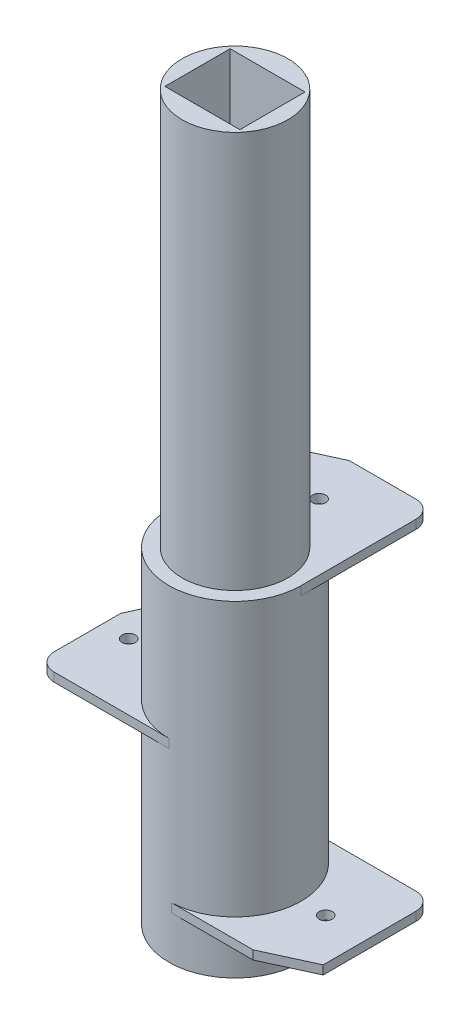
ISO-10303-21;
HEADER;
FILE_DESCRIPTION(('STEP AP214'),'2;1');
FILE_NAME('part.step','',(''),(''),'','','');
FILE_SCHEMA(('AUTOMOTIVE_DESIGN { 1 0 10303 214 1 1 1 1 }'));
ENDSEC;
DATA;
#1=APPLICATION_CONTEXT('core data for automotive mechanical design processes');
#2=APPLICATION_PROTOCOL_DEFINITION('international standard','automotive_design',2000,#1);
#3=PRODUCT_CONTEXT('',#1,'mechanical');
#4=PRODUCT('Part','Part','',(#3));
#5=PRODUCT_RELATED_PRODUCT_CATEGORY('part','',(#4));
#6=PRODUCT_DEFINITION_FORMATION('','',#4);
#7=PRODUCT_DEFINITION_CONTEXT('part definition',#1,'design');
#8=PRODUCT_DEFINITION('design','',#6,#7);
#9=PRODUCT_DEFINITION_SHAPE('','',#8);
#10=(LENGTH_UNIT() NAMED_UNIT(*) SI_UNIT(.MILLI.,.METRE.));
#11=(NAMED_UNIT(*) PLANE_ANGLE_UNIT() SI_UNIT($,.RADIAN.));
#12=(NAMED_UNIT(*) SI_UNIT($,.STERADIAN.) SOLID_ANGLE_UNIT());
#13=UNCERTAINTY_MEASURE_WITH_UNIT(LENGTH_MEASURE(1.E-05),#10,'distance_accuracy_value','');
#14=(GEOMETRIC_REPRESENTATION_CONTEXT(3) GLOBAL_UNCERTAINTY_ASSIGNED_CONTEXT((#13)) GLOBAL_UNIT_ASSIGNED_CONTEXT((#10,
#11,#12)) REPRESENTATION_CONTEXT('',''));
#15=CARTESIAN_POINT('',(0.,0.,0.));
#16=DIRECTION('',(0.,0.,1.));
#17=DIRECTION('',(1.,0.,0.));
#18=AXIS2_PLACEMENT_3D('',#15,#16,#17);
#19=CARTESIAN_POINT('',(0.,6.,-7.5));
#20=DIRECTION('',(0.,0.,-1.));
#21=DIRECTION('',(-1.,0.,0.));
#22=AXIS2_PLACEMENT_3D('',#19,#20,#21);
#23=PLANE('',#22);
#24=DIRECTION('',(1.,0.,0.));
#25=VECTOR('',#24,1.);
#26=CARTESIAN_POINT('',(0.,6.,-7.5));
#27=LINE('',#26,#25);
#28=CARTESIAN_POINT('',(0.,6.,-7.5));
#29=VERTEX_POINT('',#28);
#30=CARTESIAN_POINT('',(13.,6.,-7.5));
#31=VERTEX_POINT('',#30);
#32=EDGE_CURVE('E108',#29,#31,#27,.T.);
#33=ORIENTED_EDGE('',*,*,#32,.T.);
#34=DIRECTION('',(0.,-1.,0.));
#35=VECTOR('',#34,1.);
#36=CARTESIAN_POINT('',(13.,6.,-7.5));
#37=LINE('',#36,#35);
#38=CARTESIAN_POINT('',(13.,5.,-7.5));
#39=VERTEX_POINT('',#38);
#40=EDGE_CURVE('E144',#31,#39,#37,.T.);
#41=ORIENTED_EDGE('',*,*,#40,.T.);
#42=DIRECTION('',(1.,0.,0.));
#43=VECTOR('',#42,1.);
#44=CARTESIAN_POINT('',(0.,5.,-7.5));
#45=LINE('',#44,#43);
#46=CARTESIAN_POINT('',(0.,5.,-7.5));
#47=VERTEX_POINT('',#46);
#48=EDGE_CURVE('E123',#47,#39,#45,.T.);
#49=ORIENTED_EDGE('',*,*,#48,.F.);
#50=DIRECTION('',(0.,-1.,0.));
#51=VECTOR('',#50,1.);
#52=CARTESIAN_POINT('',(0.,6.,-7.5));
#53=LINE('',#52,#51);
#54=EDGE_CURVE('E142',#29,#47,#53,.T.);
#55=ORIENTED_EDGE('',*,*,#54,.F.);
#56=EDGE_LOOP('',(#33,#41,#49,#55));
#57=FACE_BOUND('',#56,.T.);
#58=ADVANCED_FACE('F50',(#57),#23,.T.);
#59=CARTESIAN_POINT('',(0.,6.,0.00250088414878794));
#60=DIRECTION('',(0.,-1.,0.));
#61=DIRECTION('',(0.,0.,-1.));
#62=AXIS2_PLACEMENT_3D('',#59,#60,#61);
#63=CYLINDRICAL_SURFACE('',#62,7.50250088414879);
#64=CARTESIAN_POINT('',(0.,5.,0.00250088414878794));
#65=DIRECTION('',(0.,1.,0.));
#66=DIRECTION('',(0.,0.,1.));
#67=AXIS2_PLACEMENT_3D('',#64,#65,#66);
#68=CIRCLE('',#67,7.50250088414879);
#69=CARTESIAN_POINT('',(0.273045899963733,5.,7.50003150783859));
#70=VERTEX_POINT('',#69);
#71=EDGE_CURVE('E137',#47,#70,#68,.F.);
#72=ORIENTED_EDGE('',*,*,#71,.T.);
#73=DIRECTION('',(0.,-1.,0.));
#74=VECTOR('',#73,1.);
#75=CARTESIAN_POINT('',(0.273045899963733,6.,7.50003150783859));
#76=LINE('',#75,#74);
#77=CARTESIAN_POINT('',(0.273045899963733,6.,7.50003150783859));
#78=VERTEX_POINT('',#77);
#79=EDGE_CURVE('E135',#78,#70,#76,.T.);
#80=ORIENTED_EDGE('',*,*,#79,.F.);
#81=CARTESIAN_POINT('',(0.,6.,0.00250088414878794));
#82=DIRECTION('',(0.,1.,0.));
#83=DIRECTION('',(0.,0.,1.));
#84=AXIS2_PLACEMENT_3D('',#81,#82,#83);
#85=CIRCLE('',#84,7.50250088414879);
#86=EDGE_CURVE('E129',#29,#78,#85,.F.);
#87=ORIENTED_EDGE('',*,*,#86,.F.);
#88=ORIENTED_EDGE('',*,*,#54,.T.);
#89=EDGE_LOOP('',(#72,#80,#87,#88));
#90=FACE_BOUND('',#89,.T.);
#91=ADVANCED_FACE('F168',(#90),#63,.F.);
#92=CARTESIAN_POINT('',(0.,6.,7.50003150783859));
#93=DIRECTION('',(0.,0.,-1.));
#94=DIRECTION('',(-1.,0.,0.));
#95=AXIS2_PLACEMENT_3D('',#92,#93,#94);
#96=PLANE('',#95);
#97=DIRECTION('',(1.,0.,0.));
#98=VECTOR('',#97,1.);
#99=CARTESIAN_POINT('',(0.,5.,7.50003150783859));
#100=LINE('',#99,#98);
#101=CARTESIAN_POINT('',(9.54564394268214,5.,7.50003150783859));
#102=VERTEX_POINT('',#101);
#103=EDGE_CURVE('E109',#70,#102,#100,.T.);
#104=ORIENTED_EDGE('',*,*,#103,.T.);
#105=DIRECTION('',(0.,1.,0.));
#106=VECTOR('',#105,1.);
#107=CARTESIAN_POINT('',(9.54564394268214,5.,7.50003150783859));
#108=LINE('',#107,#106);
#109=CARTESIAN_POINT('',(9.54564394268214,6.,7.50003150783859));
#110=VERTEX_POINT('',#109);
#111=EDGE_CURVE('E117',#102,#110,#108,.T.);
#112=ORIENTED_EDGE('',*,*,#111,.T.);
#113=DIRECTION('',(1.,0.,0.));
#114=VECTOR('',#113,1.);
#115=CARTESIAN_POINT('',(0.,6.,7.50003150783859));
#116=LINE('',#115,#114);
#117=EDGE_CURVE('E131',#78,#110,#116,.T.);
#118=ORIENTED_EDGE('',*,*,#117,.F.);
#119=ORIENTED_EDGE('',*,*,#79,.T.);
#120=EDGE_LOOP('',(#104,#112,#118,#119));
#121=FACE_BOUND('',#120,.T.);
#122=ADVANCED_FACE('F172',(#121),#96,.F.);
#123=CARTESIAN_POINT('',(15.,6.,0.));
#124=DIRECTION('',(1.,0.,0.));
#125=DIRECTION('',(0.,0.,-1.));
#126=AXIS2_PLACEMENT_3D('',#123,#124,#125);
#127=PLANE('',#126);
#128=DIRECTION('',(0.,0.,1.));
#129=VECTOR('',#128,1.);
#130=CARTESIAN_POINT('',(15.,5.,0.));
#131=LINE('',#130,#129);
#132=CARTESIAN_POINT('',(15.,5.,-5.5));
#133=VERTEX_POINT('',#132);
#134=CARTESIAN_POINT('',(15.,5.,5.00003150783859));
#135=VERTEX_POINT('',#134);
#136=EDGE_CURVE('E101',#133,#135,#131,.T.);
#137=ORIENTED_EDGE('',*,*,#136,.F.);
#138=DIRECTION('',(0.,-1.,0.));
#139=VECTOR('',#138,1.);
#140=CARTESIAN_POINT('',(15.,6.,-5.5));
#141=LINE('',#140,#139);
#142=CARTESIAN_POINT('',(15.,6.,-5.5));
#143=VERTEX_POINT('',#142);
#144=EDGE_CURVE('E65',#133,#143,#141,.F.);
#145=ORIENTED_EDGE('',*,*,#144,.T.);
#146=DIRECTION('',(0.,0.,1.));
#147=VECTOR('',#146,1.);
#148=CARTESIAN_POINT('',(15.,6.,0.));
#149=LINE('',#148,#147);
#150=CARTESIAN_POINT('',(15.,6.,5.00003150783859));
#151=VERTEX_POINT('',#150);
#152=EDGE_CURVE('E121',#143,#151,#149,.T.);
#153=ORIENTED_EDGE('',*,*,#152,.T.);
#154=DIRECTION('',(0.,1.,0.));
#155=VECTOR('',#154,1.);
#156=CARTESIAN_POINT('',(15.,5.,5.00003150783859));
#157=LINE('',#156,#155);
#158=EDGE_CURVE('E114',#135,#151,#157,.T.);
#159=ORIENTED_EDGE('',*,*,#158,.F.);
#160=EDGE_LOOP('',(#137,#145,#153,#159));
#161=FACE_BOUND('',#160,.T.);
#162=ADVANCED_FACE('F120',(#161),#127,.T.);
#163=CARTESIAN_POINT('',(0.,6.,0.));
#164=DIRECTION('',(0.,1.,0.));
#165=DIRECTION('',(0.,0.,1.));
#166=AXIS2_PLACEMENT_3D('',#163,#164,#165);
#167=PLANE('',#166);
#168=CARTESIAN_POINT('',(10.2862497684504,6.,0.));
#169=DIRECTION('',(0.,1.,0.));
#170=DIRECTION('',(0.,0.,1.));
#171=AXIS2_PLACEMENT_3D('',#168,#169,#170);
#172=CIRCLE('',#171,0.75);
#173=CARTESIAN_POINT('',(10.2862497684504,6.,0.75));
#174=VERTEX_POINT('',#173);
#175=EDGE_CURVE('E198',#174,#174,#172,.T.);
#176=ORIENTED_EDGE('',*,*,#175,.F.);
#177=EDGE_LOOP('',(#176));
#178=FACE_BOUND('',#177,.T.);
#179=ORIENTED_EDGE('',*,*,#152,.F.);
#180=CARTESIAN_POINT('',(13.,6.,-5.5));
#181=DIRECTION('',(0.,1.,0.));
#182=DIRECTION('',(0.,0.,1.));
#183=AXIS2_PLACEMENT_3D('',#180,#181,#182);
#184=CIRCLE('',#183,2.);
#185=EDGE_CURVE('E58',#143,#31,#184,.T.);
#186=ORIENTED_EDGE('',*,*,#185,.T.);
#187=ORIENTED_EDGE('',*,*,#32,.F.);
#188=ORIENTED_EDGE('',*,*,#86,.T.);
#189=ORIENTED_EDGE('',*,*,#117,.T.);
#190=DIRECTION('',(-0.909059342886309,0.,0.416666666666667));
#191=VECTOR('',#190,1.);
#192=CARTESIAN_POINT('',(15.,6.,5.00003150783859));
#193=LINE('',#192,#191);
#194=EDGE_CURVE('E118',#151,#110,#193,.T.);
#195=ORIENTED_EDGE('',*,*,#194,.F.);
#196=EDGE_LOOP('',(#179,#186,#187,#188,#189,#195));
#197=FACE_BOUND('',#196,.T.);
#198=ADVANCED_FACE('F151',(#178,#197),#167,.T.);
#199=CARTESIAN_POINT('',(0.,5.,0.));
#200=DIRECTION('',(0.,1.,0.));
#201=DIRECTION('',(0.,0.,1.));
#202=AXIS2_PLACEMENT_3D('',#199,#200,#201);
#203=PLANE('',#202);
#204=CARTESIAN_POINT('',(10.2862497684504,5.,0.));
#205=DIRECTION('',(0.,-1.,0.));
#206=DIRECTION('',(0.,0.,-1.));
#207=AXIS2_PLACEMENT_3D('',#204,#205,#206);
#208=CIRCLE('',#207,0.75);
#209=CARTESIAN_POINT('',(10.2862497684504,5.,-0.75));
#210=VERTEX_POINT('',#209);
#211=EDGE_CURVE('E201',#210,#210,#208,.T.);
#212=ORIENTED_EDGE('',*,*,#211,.F.);
#213=EDGE_LOOP('',(#212));
#214=FACE_BOUND('',#213,.T.);
#215=CARTESIAN_POINT('',(11.,5.,-4.));
#216=DIRECTION('',(0.,1.,0.));
#217=DIRECTION('',(0.,0.,1.));
#218=AXIS2_PLACEMENT_3D('',#215,#216,#217);
#219=CIRCLE('',#218,0.7);
#220=CARTESIAN_POINT('',(11.,5.,-3.3));
#221=VERTEX_POINT('',#220);
#222=EDGE_CURVE('E12',#221,#221,#219,.F.);
#223=ORIENTED_EDGE('',*,*,#222,.F.);
#224=EDGE_LOOP('',(#223));
#225=FACE_BOUND('',#224,.T.);
#226=ORIENTED_EDGE('',*,*,#48,.T.);
#227=CARTESIAN_POINT('',(13.,5.,-5.5));
#228=DIRECTION('',(0.,1.,0.));
#229=DIRECTION('',(0.,0.,1.));
#230=AXIS2_PLACEMENT_3D('',#227,#228,#229);
#231=CIRCLE('',#230,2.);
#232=EDGE_CURVE('E73',#39,#133,#231,.F.);
#233=ORIENTED_EDGE('',*,*,#232,.T.);
#234=ORIENTED_EDGE('',*,*,#136,.T.);
#235=DIRECTION('',(-0.909059342886309,0.,0.416666666666667));
#236=VECTOR('',#235,1.);
#237=CARTESIAN_POINT('',(15.,5.,5.00003150783859));
#238=LINE('',#237,#236);
#239=EDGE_CURVE('E105',#135,#102,#238,.T.);
#240=ORIENTED_EDGE('',*,*,#239,.T.);
#241=ORIENTED_EDGE('',*,*,#103,.F.);
#242=ORIENTED_EDGE('',*,*,#71,.F.);
#243=EDGE_LOOP('',(#226,#233,#234,#240,#241,#242));
#244=FACE_BOUND('',#243,.T.);
#245=ADVANCED_FACE('F103',(#214,#225,#244),#203,.F.);
#246=CARTESIAN_POINT('',(15.,5.,5.00003150783859));
#247=DIRECTION('',(-0.416666666666667,0.,-0.909059342886309));
#248=DIRECTION('',(-0.90905934288631,0.,0.416666666666667));
#249=AXIS2_PLACEMENT_3D('',#246,#247,#248);
#250=PLANE('',#249);
#251=ORIENTED_EDGE('',*,*,#194,.T.);
#252=ORIENTED_EDGE('',*,*,#111,.F.);
#253=ORIENTED_EDGE('',*,*,#239,.F.);
#254=ORIENTED_EDGE('',*,*,#158,.T.);
#255=EDGE_LOOP('',(#251,#252,#253,#254));
#256=FACE_BOUND('',#255,.T.);
#257=ADVANCED_FACE('F113',(#256),#250,.F.);
#258=CARTESIAN_POINT('',(13.,6.,-5.5));
#259=DIRECTION('',(0.,-1.,0.));
#260=DIRECTION('',(0.,0.,-1.));
#261=AXIS2_PLACEMENT_3D('',#258,#259,#260);
#262=CYLINDRICAL_SURFACE('',#261,2.);
#263=ORIENTED_EDGE('',*,*,#185,.F.);
#264=ORIENTED_EDGE('',*,*,#144,.F.);
#265=ORIENTED_EDGE('',*,*,#232,.F.);
#266=ORIENTED_EDGE('',*,*,#40,.F.);
#267=EDGE_LOOP('',(#263,#264,#265,#266));
#268=FACE_BOUND('',#267,.T.);
#269=ADVANCED_FACE('F52',(#268),#262,.T.);
#270=CARTESIAN_POINT('',(11.,3.8,-4.));
#271=DIRECTION('',(0.,1.,0.));
#272=DIRECTION('',(0.,0.,1.));
#273=AXIS2_PLACEMENT_3D('',#270,#271,#272);
#274=CYLINDRICAL_SURFACE('',#273,0.7);
#275=CARTESIAN_POINT('',(11.,3.8,-4.));
#276=DIRECTION('',(0.,-1.,0.));
#277=DIRECTION('',(0.,0.,-1.));
#278=AXIS2_PLACEMENT_3D('',#275,#276,#277);
#279=CIRCLE('',#278,0.7);
#280=CARTESIAN_POINT('',(11.,3.8,-4.7));
#281=VERTEX_POINT('',#280);
#282=EDGE_CURVE('E203',#281,#281,#279,.T.);
#283=ORIENTED_EDGE('',*,*,#282,.F.);
#284=EDGE_LOOP('',(#283));
#285=FACE_BOUND('',#284,.T.);
#286=ORIENTED_EDGE('',*,*,#222,.T.);
#287=EDGE_LOOP('',(#286));
#288=FACE_BOUND('',#287,.T.);
#289=ADVANCED_FACE('F158',(#285,#288),#274,.T.);
#290=CARTESIAN_POINT('',(11.,3.8,-4.));
#291=DIRECTION('',(0.,-1.,0.));
#292=DIRECTION('',(0.,0.,-1.));
#293=AXIS2_PLACEMENT_3D('',#290,#291,#292);
#294=PLANE('',#293);
#295=ORIENTED_EDGE('',*,*,#282,.T.);
#296=EDGE_LOOP('',(#295));
#297=FACE_BOUND('',#296,.T.);
#298=ADVANCED_FACE('F163',(#297),#294,.T.);
#299=CARTESIAN_POINT('',(10.2862497684504,7.,0.));
#300=DIRECTION('',(0.,-1.,0.));
#301=DIRECTION('',(0.,0.,-1.));
#302=AXIS2_PLACEMENT_3D('',#299,#300,#301);
#303=CYLINDRICAL_SURFACE('',#302,0.75);
#304=ORIENTED_EDGE('',*,*,#175,.T.);
#305=EDGE_LOOP('',(#304));
#306=FACE_BOUND('',#305,.T.);
#307=ORIENTED_EDGE('',*,*,#211,.T.);
#308=EDGE_LOOP('',(#307));
#309=FACE_BOUND('',#308,.T.);
#310=ADVANCED_FACE('F189',(#306,#309),#303,.F.);
#311=CLOSED_SHELL('',(#58,#91,#122,#162,#198,#245,#257,#269,#289,#298,#310));
#312=MANIFOLD_SOLID_BREP('B2',#311);
#313=CARTESIAN_POINT('',(0.,5.,0.));
#314=DIRECTION('',(0.,-1.,0.));
#315=DIRECTION('',(0.,0.,-1.));
#316=AXIS2_PLACEMENT_3D('',#313,#314,#315);
#317=CYLINDRICAL_SURFACE('',#316,7.5);
#318=CARTESIAN_POINT('',(0.,0.,0.));
#319=DIRECTION('',(0.,1.,0.));
#320=DIRECTION('',(0.,0.,1.));
#321=AXIS2_PLACEMENT_3D('',#318,#319,#320);
#322=CIRCLE('',#321,7.5);
#323=CARTESIAN_POINT('',(0.,0.,7.5));
#324=VERTEX_POINT('',#323);
#325=EDGE_CURVE('E486',#324,#324,#322,.T.);
#326=ORIENTED_EDGE('',*,*,#325,.T.);
#327=EDGE_LOOP('',(#326));
#328=FACE_BOUND('',#327,.T.);
#329=DIRECTION('',(0.,-1.,0.));
#330=VECTOR('',#329,1.);
#331=CARTESIAN_POINT('',(0.,22.,-7.5));
#332=LINE('',#331,#330);
#333=CARTESIAN_POINT('',(0.,22.,-7.5));
#334=VERTEX_POINT('',#333);
#335=CARTESIAN_POINT('',(0.,21.,-7.5));
#336=VERTEX_POINT('',#335);
#337=EDGE_CURVE('E534',#334,#336,#332,.T.);
#338=ORIENTED_EDGE('',*,*,#337,.F.);
#339=CARTESIAN_POINT('',(0.,22.,0.));
#340=DIRECTION('',(0.,-1.,0.));
#341=DIRECTION('',(0.,0.,1.));
#342=AXIS2_PLACEMENT_3D('',#339,#340,#341);
#343=CIRCLE('',#342,7.5);
#344=CARTESIAN_POINT('',(0.,22.,7.5));
#345=VERTEX_POINT('',#344);
#346=EDGE_CURVE('E511',#345,#334,#343,.T.);
#347=ORIENTED_EDGE('',*,*,#346,.F.);
#348=DIRECTION('',(0.,-1.,0.));
#349=VECTOR('',#348,1.);
#350=CARTESIAN_POINT('',(0.,22.,7.5));
#351=LINE('',#350,#349);
#352=CARTESIAN_POINT('',(0.,21.,7.5));
#353=VERTEX_POINT('',#352);
#354=EDGE_CURVE('E523',#345,#353,#351,.T.);
#355=ORIENTED_EDGE('',*,*,#354,.T.);
#356=CARTESIAN_POINT('',(0.,21.,0.));
#357=DIRECTION('',(0.,-1.,0.));
#358=DIRECTION('',(0.,0.,1.));
#359=AXIS2_PLACEMENT_3D('',#356,#357,#358);
#360=CIRCLE('',#359,7.5);
#361=EDGE_CURVE('E510',#353,#336,#360,.T.);
#362=ORIENTED_EDGE('',*,*,#361,.T.);
#363=EDGE_LOOP('',(#338,#347,#355,#362));
#364=FACE_BOUND('',#363,.T.);
#365=DIRECTION('',(0.,-1.,0.));
#366=VECTOR('',#365,1.);
#367=CARTESIAN_POINT('',(7.5,37.,0.));
#368=LINE('',#367,#366);
#369=CARTESIAN_POINT('',(7.5,37.,0.));
#370=VERTEX_POINT('',#369);
#371=CARTESIAN_POINT('',(7.5,36.,0.));
#372=VERTEX_POINT('',#371);
#373=EDGE_CURVE('E504',#370,#372,#368,.T.);
#374=ORIENTED_EDGE('',*,*,#373,.F.);
#375=CARTESIAN_POINT('',(0.,37.,0.));
#376=DIRECTION('',(0.,1.,0.));
#377=DIRECTION('',(0.,0.,1.));
#378=AXIS2_PLACEMENT_3D('',#375,#376,#377);
#379=CIRCLE('',#378,7.5);
#380=CARTESIAN_POINT('',(-7.49999999999999,37.,0.));
#381=VERTEX_POINT('',#380);
#382=EDGE_CURVE('E507',#381,#370,#379,.T.);
#383=ORIENTED_EDGE('',*,*,#382,.F.);
#384=DIRECTION('',(0.,-1.,0.));
#385=VECTOR('',#384,1.);
#386=CARTESIAN_POINT('',(-7.49999999999999,37.,0.));
#387=LINE('',#386,#385);
#388=CARTESIAN_POINT('',(-7.49999999999999,36.,0.));
#389=VERTEX_POINT('',#388);
#390=EDGE_CURVE('E494',#381,#389,#387,.T.);
#391=ORIENTED_EDGE('',*,*,#390,.T.);
#392=CARTESIAN_POINT('',(0.,36.,0.));
#393=DIRECTION('',(0.,-1.,0.));
#394=DIRECTION('',(0.,0.,-1.));
#395=AXIS2_PLACEMENT_3D('',#392,#393,#394);
#396=CIRCLE('',#395,7.5);
#397=EDGE_CURVE('E481',#389,#372,#396,.T.);
#398=ORIENTED_EDGE('',*,*,#397,.T.);
#399=EDGE_LOOP('',(#374,#383,#391,#398));
#400=FACE_BOUND('',#399,.T.);
#401=ADVANCED_FACE('F298',(#328,#364,#400),#317,.T.);
#402=CARTESIAN_POINT('',(0.,0.,0.));
#403=DIRECTION('',(0.,1.,0.));
#404=DIRECTION('',(0.,0.,1.));
#405=AXIS2_PLACEMENT_3D('',#402,#403,#404);
#406=PLANE('',#405);
#407=CARTESIAN_POINT('',(0.,0.,0.));
#408=DIRECTION('',(0.,-1.,0.));
#409=DIRECTION('',(0.,0.,-1.));
#410=AXIS2_PLACEMENT_3D('',#407,#408,#409);
#411=CIRCLE('',#410,4.2);
#412=CARTESIAN_POINT('',(0.,0.,-4.2));
#413=VERTEX_POINT('',#412);
#414=EDGE_CURVE('E541',#413,#413,#411,.T.);
#415=ORIENTED_EDGE('',*,*,#414,.F.);
#416=EDGE_LOOP('',(#415));
#417=FACE_BOUND('',#416,.T.);
#418=ORIENTED_EDGE('',*,*,#325,.F.);
#419=EDGE_LOOP('',(#418));
#420=FACE_BOUND('',#419,.T.);
#421=ADVANCED_FACE('F586',(#417,#420),#406,.F.);
#422=CARTESIAN_POINT('',(0.,2.,0.));
#423=DIRECTION('',(0.,-1.,0.));
#424=DIRECTION('',(0.,0.,-1.));
#425=AXIS2_PLACEMENT_3D('',#422,#423,#424);
#426=CYLINDRICAL_SURFACE('',#425,4.2);
#427=CARTESIAN_POINT('',(0.,2.,0.));
#428=DIRECTION('',(0.,-1.,0.));
#429=DIRECTION('',(0.,0.,-1.));
#430=AXIS2_PLACEMENT_3D('',#427,#428,#429);
#431=CIRCLE('',#430,4.2);
#432=CARTESIAN_POINT('',(0.,2.,-4.2));
#433=VERTEX_POINT('',#432);
#434=EDGE_CURVE('E544',#433,#433,#431,.T.);
#435=ORIENTED_EDGE('',*,*,#434,.F.);
#436=EDGE_LOOP('',(#435));
#437=FACE_BOUND('',#436,.T.);
#438=ORIENTED_EDGE('',*,*,#414,.T.);
#439=EDGE_LOOP('',(#438));
#440=FACE_BOUND('',#439,.T.);
#441=ADVANCED_FACE('F592',(#437,#440),#426,.F.);
#442=CARTESIAN_POINT('',(0.,2.,0.));
#443=DIRECTION('',(0.,-1.,0.));
#444=DIRECTION('',(0.,0.,-1.));
#445=AXIS2_PLACEMENT_3D('',#442,#443,#444);
#446=PLANE('',#445);
#447=CARTESIAN_POINT('',(0.,2.,0.));
#448=DIRECTION('',(0.,-1.,0.));
#449=DIRECTION('',(0.,0.,-1.));
#450=AXIS2_PLACEMENT_3D('',#447,#448,#449);
#451=CIRCLE('',#450,2.1);
#452=CARTESIAN_POINT('',(0.,2.,-2.1));
#453=VERTEX_POINT('',#452);
#454=EDGE_CURVE('E537',#453,#453,#451,.T.);
#455=ORIENTED_EDGE('',*,*,#454,.F.);
#456=EDGE_LOOP('',(#455));
#457=FACE_BOUND('',#456,.T.);
#458=ORIENTED_EDGE('',*,*,#434,.T.);
#459=EDGE_LOOP('',(#458));
#460=FACE_BOUND('',#459,.T.);
#461=ADVANCED_FACE('F599',(#457,#460),#446,.T.);
#462=CARTESIAN_POINT('',(0.,11.,0.));
#463=DIRECTION('',(0.,-1.,0.));
#464=DIRECTION('',(0.,0.,-1.));
#465=AXIS2_PLACEMENT_3D('',#462,#463,#464);
#466=CYLINDRICAL_SURFACE('',#465,2.1);
#467=CARTESIAN_POINT('',(0.,11.,0.));
#468=DIRECTION('',(0.,-1.,0.));
#469=DIRECTION('',(0.,0.,-1.));
#470=AXIS2_PLACEMENT_3D('',#467,#468,#469);
#471=CIRCLE('',#470,2.1);
#472=CARTESIAN_POINT('',(0.,11.,-2.1));
#473=VERTEX_POINT('',#472);
#474=EDGE_CURVE('E538',#473,#473,#471,.T.);
#475=ORIENTED_EDGE('',*,*,#474,.F.);
#476=EDGE_LOOP('',(#475));
#477=FACE_BOUND('',#476,.T.);
#478=ORIENTED_EDGE('',*,*,#454,.T.);
#479=EDGE_LOOP('',(#478));
#480=FACE_BOUND('',#479,.T.);
#481=ADVANCED_FACE('F603',(#477,#480),#466,.F.);
#482=CARTESIAN_POINT('',(0.,11.,0.));
#483=DIRECTION('',(0.,-1.,0.));
#484=DIRECTION('',(0.,0.,-1.));
#485=AXIS2_PLACEMENT_3D('',#482,#483,#484);
#486=PLANE('',#485);
#487=ORIENTED_EDGE('',*,*,#474,.T.);
#488=EDGE_LOOP('',(#487));
#489=FACE_BOUND('',#488,.T.);
#490=ADVANCED_FACE('F607',(#489),#486,.T.);
#491=CARTESIAN_POINT('',(0.,22.,-7.5));
#492=DIRECTION('',(0.,0.,1.));
#493=DIRECTION('',(1.,0.,0.));
#494=AXIS2_PLACEMENT_3D('',#491,#492,#493);
#495=PLANE('',#494);
#496=DIRECTION('',(-1.,0.,0.));
#497=VECTOR('',#496,1.);
#498=CARTESIAN_POINT('',(0.,21.,-7.5));
#499=LINE('',#498,#497);
#500=CARTESIAN_POINT('',(-12.5,21.,-7.5));
#501=VERTEX_POINT('',#500);
#502=EDGE_CURVE('E525',#336,#501,#499,.T.);
#503=ORIENTED_EDGE('',*,*,#502,.T.);
#504=DIRECTION('',(0.,1.,0.));
#505=VECTOR('',#504,1.);
#506=CARTESIAN_POINT('',(-12.5,21.,-7.5));
#507=LINE('',#506,#505);
#508=CARTESIAN_POINT('',(-12.5,22.,-7.5));
#509=VERTEX_POINT('',#508);
#510=EDGE_CURVE('E463',#501,#509,#507,.T.);
#511=ORIENTED_EDGE('',*,*,#510,.T.);
#512=DIRECTION('',(-1.,0.,0.));
#513=VECTOR('',#512,1.);
#514=CARTESIAN_POINT('',(0.,22.,-7.5));
#515=LINE('',#514,#513);
#516=EDGE_CURVE('E514',#334,#509,#515,.T.);
#517=ORIENTED_EDGE('',*,*,#516,.F.);
#518=ORIENTED_EDGE('',*,*,#337,.T.);
#519=EDGE_LOOP('',(#503,#511,#517,#518));
#520=FACE_BOUND('',#519,.T.);
#521=ADVANCED_FACE('F611',(#520),#495,.F.);
#522=CARTESIAN_POINT('',(-15.,22.,-7.5));
#523=DIRECTION('',(1.,0.,0.));
#524=DIRECTION('',(0.,0.,-1.));
#525=AXIS2_PLACEMENT_3D('',#522,#523,#524);
#526=PLANE('',#525);
#527=DIRECTION('',(0.,0.,1.));
#528=VECTOR('',#527,1.);
#529=CARTESIAN_POINT('',(-15.,21.,-7.5));
#530=LINE('',#529,#528);
#531=CARTESIAN_POINT('',(-15.,21.,-2.04564394268214));
#532=VERTEX_POINT('',#531);
#533=CARTESIAN_POINT('',(-15.,21.,5.5));
#534=VERTEX_POINT('',#533);
#535=EDGE_CURVE('E528',#532,#534,#530,.T.);
#536=ORIENTED_EDGE('',*,*,#535,.T.);
#537=DIRECTION('',(0.,-1.,0.));
#538=VECTOR('',#537,1.);
#539=CARTESIAN_POINT('',(-15.,22.,5.5));
#540=LINE('',#539,#538);
#541=CARTESIAN_POINT('',(-15.,22.,5.5));
#542=VERTEX_POINT('',#541);
#543=EDGE_CURVE('E555',#534,#542,#540,.F.);
#544=ORIENTED_EDGE('',*,*,#543,.T.);
#545=DIRECTION('',(0.,0.,1.));
#546=VECTOR('',#545,1.);
#547=CARTESIAN_POINT('',(-15.,22.,-7.5));
#548=LINE('',#547,#546);
#549=CARTESIAN_POINT('',(-15.,22.,-2.04564394268214));
#550=VERTEX_POINT('',#549);
#551=EDGE_CURVE('E518',#550,#542,#548,.T.);
#552=ORIENTED_EDGE('',*,*,#551,.F.);
#553=DIRECTION('',(0.,1.,0.));
#554=VECTOR('',#553,1.);
#555=CARTESIAN_POINT('',(-15.,21.,-2.04564394268214));
#556=LINE('',#555,#554);
#557=EDGE_CURVE('E461',#532,#550,#556,.T.);
#558=ORIENTED_EDGE('',*,*,#557,.F.);
#559=EDGE_LOOP('',(#536,#544,#552,#558));
#560=FACE_BOUND('',#559,.T.);
#561=ADVANCED_FACE('F615',(#560),#526,.F.);
#562=CARTESIAN_POINT('',(0.,22.,7.5));
#563=DIRECTION('',(0.,0.,-1.));
#564=DIRECTION('',(-1.,0.,0.));
#565=AXIS2_PLACEMENT_3D('',#562,#563,#564);
#566=PLANE('',#565);
#567=DIRECTION('',(1.,0.,0.));
#568=VECTOR('',#567,1.);
#569=CARTESIAN_POINT('',(0.,22.,7.5));
#570=LINE('',#569,#568);
#571=CARTESIAN_POINT('',(-13.,22.,7.5));
#572=VERTEX_POINT('',#571);
#573=EDGE_CURVE('E521',#572,#345,#570,.T.);
#574=ORIENTED_EDGE('',*,*,#573,.F.);
#575=DIRECTION('',(0.,-1.,0.));
#576=VECTOR('',#575,1.);
#577=CARTESIAN_POINT('',(-13.,22.,7.5));
#578=LINE('',#577,#576);
#579=CARTESIAN_POINT('',(-13.,21.,7.5));
#580=VERTEX_POINT('',#579);
#581=EDGE_CURVE('E485',#572,#580,#578,.T.);
#582=ORIENTED_EDGE('',*,*,#581,.T.);
#583=DIRECTION('',(1.,0.,0.));
#584=VECTOR('',#583,1.);
#585=CARTESIAN_POINT('',(0.,21.,7.5));
#586=LINE('',#585,#584);
#587=EDGE_CURVE('E515',#580,#353,#586,.T.);
#588=ORIENTED_EDGE('',*,*,#587,.T.);
#589=ORIENTED_EDGE('',*,*,#354,.F.);
#590=EDGE_LOOP('',(#574,#582,#588,#589));
#591=FACE_BOUND('',#590,.T.);
#592=ADVANCED_FACE('F619',(#591),#566,.F.);
#593=CARTESIAN_POINT('',(0.,22.,0.));
#594=DIRECTION('',(0.,1.,0.));
#595=DIRECTION('',(0.,0.,1.));
#596=AXIS2_PLACEMENT_3D('',#593,#594,#595);
#597=PLANE('',#596);
#598=CARTESIAN_POINT('',(-12.0541989474028,22.,0.));
#599=DIRECTION('',(0.,1.,0.));
#600=DIRECTION('',(0.,0.,1.));
#601=AXIS2_PLACEMENT_3D('',#598,#599,#600);
#602=CIRCLE('',#601,0.75);
#603=CARTESIAN_POINT('',(-12.0541989474028,22.,0.75));
#604=VERTEX_POINT('',#603);
#605=EDGE_CURVE('E701',#604,#604,#602,.T.);
#606=ORIENTED_EDGE('',*,*,#605,.F.);
#607=EDGE_LOOP('',(#606));
#608=FACE_BOUND('',#607,.T.);
#609=ORIENTED_EDGE('',*,*,#551,.T.);
#610=CARTESIAN_POINT('',(-13.,22.,5.5));
#611=DIRECTION('',(0.,1.,0.));
#612=DIRECTION('',(0.,0.,1.));
#613=AXIS2_PLACEMENT_3D('',#610,#611,#612);
#614=CIRCLE('',#613,2.);
#615=EDGE_CURVE('E557',#542,#572,#614,.T.);
#616=ORIENTED_EDGE('',*,*,#615,.T.);
#617=ORIENTED_EDGE('',*,*,#573,.T.);
#618=ORIENTED_EDGE('',*,*,#346,.T.);
#619=ORIENTED_EDGE('',*,*,#516,.T.);
#620=DIRECTION('',(0.416666666666667,0.,-0.90905934288631));
#621=VECTOR('',#620,1.);
#622=CARTESIAN_POINT('',(-15.,22.,-2.04564394268214));
#623=LINE('',#622,#621);
#624=EDGE_CURVE('E454',#550,#509,#623,.T.);
#625=ORIENTED_EDGE('',*,*,#624,.F.);
#626=EDGE_LOOP('',(#609,#616,#617,#618,#619,#625));
#627=FACE_BOUND('',#626,.T.);
#628=ADVANCED_FACE('F623',(#608,#627),#597,.T.);
#629=CARTESIAN_POINT('',(0.,21.,0.));
#630=DIRECTION('',(0.,1.,0.));
#631=DIRECTION('',(0.,0.,1.));
#632=AXIS2_PLACEMENT_3D('',#629,#630,#631);
#633=PLANE('',#632);
#634=CARTESIAN_POINT('',(-12.0541989474028,21.,0.));
#635=DIRECTION('',(0.,-1.,0.));
#636=DIRECTION('',(0.,0.,-1.));
#637=AXIS2_PLACEMENT_3D('',#634,#635,#636);
#638=CIRCLE('',#637,0.75);
#639=CARTESIAN_POINT('',(-12.0541989474028,21.,-0.75));
#640=VERTEX_POINT('',#639);
#641=EDGE_CURVE('E704',#640,#640,#638,.T.);
#642=ORIENTED_EDGE('',*,*,#641,.F.);
#643=EDGE_LOOP('',(#642));
#644=FACE_BOUND('',#643,.T.);
#645=CARTESIAN_POINT('',(-11.,21.,4.));
#646=DIRECTION('',(0.,1.,0.));
#647=DIRECTION('',(0.,0.,1.));
#648=AXIS2_PLACEMENT_3D('',#645,#646,#647);
#649=CIRCLE('',#648,0.7);
#650=CARTESIAN_POINT('',(-11.,21.,4.7));
#651=VERTEX_POINT('',#650);
#652=EDGE_CURVE('E48',#651,#651,#649,.F.);
#653=ORIENTED_EDGE('',*,*,#652,.F.);
#654=EDGE_LOOP('',(#653));
#655=FACE_BOUND('',#654,.T.);
#656=ORIENTED_EDGE('',*,*,#587,.F.);
#657=CARTESIAN_POINT('',(-13.,21.,5.5));
#658=DIRECTION('',(0.,1.,0.));
#659=DIRECTION('',(0.,0.,1.));
#660=AXIS2_PLACEMENT_3D('',#657,#658,#659);
#661=CIRCLE('',#660,2.);
#662=EDGE_CURVE('E553',#580,#534,#661,.F.);
#663=ORIENTED_EDGE('',*,*,#662,.T.);
#664=ORIENTED_EDGE('',*,*,#535,.F.);
#665=DIRECTION('',(0.416666666666667,0.,-0.90905934288631));
#666=VECTOR('',#665,1.);
#667=CARTESIAN_POINT('',(-15.,21.,-2.04564394268214));
#668=LINE('',#667,#666);
#669=EDGE_CURVE('E458',#532,#501,#668,.T.);
#670=ORIENTED_EDGE('',*,*,#669,.T.);
#671=ORIENTED_EDGE('',*,*,#502,.F.);
#672=ORIENTED_EDGE('',*,*,#361,.F.);
#673=EDGE_LOOP('',(#656,#663,#664,#670,#671,#672));
#674=FACE_BOUND('',#673,.T.);
#675=ADVANCED_FACE('F625',(#644,#655,#674),#633,.F.);
#676=CARTESIAN_POINT('',(0.,37.,0.));
#677=DIRECTION('',(0.,1.,0.));
#678=DIRECTION('',(0.,0.,1.));
#679=AXIS2_PLACEMENT_3D('',#676,#677,#678);
#680=PLANE('',#679);
#681=CARTESIAN_POINT('',(0.,37.,-9.53599974083405));
#682=DIRECTION('',(0.,1.,0.));
#683=DIRECTION('',(0.,0.,1.));
#684=AXIS2_PLACEMENT_3D('',#681,#682,#683);
#685=CIRCLE('',#684,0.75);
#686=CARTESIAN_POINT('',(0.,37.,-8.78599974083405));
#687=VERTEX_POINT('',#686);
#688=EDGE_CURVE('E711',#687,#687,#685,.T.);
#689=ORIENTED_EDGE('',*,*,#688,.F.);
#690=EDGE_LOOP('',(#689));
#691=FACE_BOUND('',#690,.T.);
#692=DIRECTION('',(0.,0.,-1.));
#693=VECTOR('',#692,1.);
#694=CARTESIAN_POINT('',(7.5,37.,0.));
#695=LINE('',#694,#693);
#696=CARTESIAN_POINT('',(7.5,37.,-13.));
#697=VERTEX_POINT('',#696);
#698=EDGE_CURVE('E487',#370,#697,#695,.T.);
#699=ORIENTED_EDGE('',*,*,#698,.T.);
#700=CARTESIAN_POINT('',(5.5,37.,-13.));
#701=DIRECTION('',(0.,1.,0.));
#702=DIRECTION('',(0.,0.,1.));
#703=AXIS2_PLACEMENT_3D('',#700,#701,#702);
#704=CIRCLE('',#703,2.);
#705=CARTESIAN_POINT('',(5.5,37.,-15.));
#706=VERTEX_POINT('',#705);
#707=EDGE_CURVE('E306',#697,#706,#704,.T.);
#708=ORIENTED_EDGE('',*,*,#707,.T.);
#709=DIRECTION('',(-1.,0.,0.));
#710=VECTOR('',#709,1.);
#711=CARTESIAN_POINT('',(7.5,37.,-15.));
#712=LINE('',#711,#710);
#713=CARTESIAN_POINT('',(-2.04564394268213,37.,-15.));
#714=VERTEX_POINT('',#713);
#715=EDGE_CURVE('E489',#706,#714,#712,.T.);
#716=ORIENTED_EDGE('',*,*,#715,.T.);
#717=DIRECTION('',(0.90905934288631,0.,-0.416666666666666));
#718=VECTOR('',#717,1.);
#719=CARTESIAN_POINT('',(-6.03676741086619,37.,-13.1706715576308));
#720=LINE('',#719,#718);
#721=CARTESIAN_POINT('',(-7.49999999999999,37.,-12.5));
#722=VERTEX_POINT('',#721);
#723=EDGE_CURVE('E466',#722,#714,#720,.T.);
#724=ORIENTED_EDGE('',*,*,#723,.F.);
#725=DIRECTION('',(0.,0.,1.));
#726=VECTOR('',#725,1.);
#727=CARTESIAN_POINT('',(-7.49999999999999,37.,0.));
#728=LINE('',#727,#726);
#729=EDGE_CURVE('E492',#722,#381,#728,.T.);
#730=ORIENTED_EDGE('',*,*,#729,.T.);
#731=ORIENTED_EDGE('',*,*,#382,.T.);
#732=EDGE_LOOP('',(#699,#708,#716,#724,#730,#731));
#733=FACE_BOUND('',#732,.T.);
#734=CARTESIAN_POINT('',(0.,37.,0.));
#735=DIRECTION('',(0.,1.,0.));
#736=DIRECTION('',(0.,0.,1.));
#737=AXIS2_PLACEMENT_3D('',#734,#735,#736);
#738=CIRCLE('',#737,6.);
#739=CARTESIAN_POINT('',(0.,37.,6.));
#740=VERTEX_POINT('',#739);
#741=EDGE_CURVE('E482',#740,#740,#738,.T.);
#742=ORIENTED_EDGE('',*,*,#741,.F.);
#743=EDGE_LOOP('',(#742));
#744=FACE_BOUND('',#743,.T.);
#745=ADVANCED_FACE('F566',(#691,#733,#744),#680,.T.);
#746=CARTESIAN_POINT('',(7.5,37.,0.));
#747=DIRECTION('',(-1.,0.,0.));
#748=DIRECTION('',(0.,0.,1.));
#749=AXIS2_PLACEMENT_3D('',#746,#747,#748);
#750=PLANE('',#749);
#751=DIRECTION('',(0.,0.,-1.));
#752=VECTOR('',#751,1.);
#753=CARTESIAN_POINT('',(7.5,36.,0.));
#754=LINE('',#753,#752);
#755=CARTESIAN_POINT('',(7.5,36.,-13.));
#756=VERTEX_POINT('',#755);
#757=EDGE_CURVE('E497',#372,#756,#754,.T.);
#758=ORIENTED_EDGE('',*,*,#757,.T.);
#759=DIRECTION('',(0.,-1.,0.));
#760=VECTOR('',#759,1.);
#761=CARTESIAN_POINT('',(7.5,37.,-13.));
#762=LINE('',#761,#760);
#763=EDGE_CURVE('E313',#756,#697,#762,.F.);
#764=ORIENTED_EDGE('',*,*,#763,.T.);
#765=ORIENTED_EDGE('',*,*,#698,.F.);
#766=ORIENTED_EDGE('',*,*,#373,.T.);
#767=EDGE_LOOP('',(#758,#764,#765,#766));
#768=FACE_BOUND('',#767,.T.);
#769=ADVANCED_FACE('F634',(#768),#750,.F.);
#770=CARTESIAN_POINT('',(7.5,37.,-15.));
#771=DIRECTION('',(0.,0.,1.));
#772=DIRECTION('',(1.,0.,0.));
#773=AXIS2_PLACEMENT_3D('',#770,#771,#772);
#774=PLANE('',#773);
#775=ORIENTED_EDGE('',*,*,#715,.F.);
#776=DIRECTION('',(0.,-1.,0.));
#777=VECTOR('',#776,1.);
#778=CARTESIAN_POINT('',(5.5,37.,-15.));
#779=LINE('',#778,#777);
#780=CARTESIAN_POINT('',(5.5,36.,-15.));
#781=VERTEX_POINT('',#780);
#782=EDGE_CURVE('E559',#706,#781,#779,.T.);
#783=ORIENTED_EDGE('',*,*,#782,.T.);
#784=DIRECTION('',(-1.,0.,0.));
#785=VECTOR('',#784,1.);
#786=CARTESIAN_POINT('',(7.5,36.,-15.));
#787=LINE('',#786,#785);
#788=CARTESIAN_POINT('',(-2.04564394268212,36.,-15.));
#789=VERTEX_POINT('',#788);
#790=EDGE_CURVE('E499',#781,#789,#787,.T.);
#791=ORIENTED_EDGE('',*,*,#790,.T.);
#792=DIRECTION('',(0.,1.,0.));
#793=VECTOR('',#792,1.);
#794=CARTESIAN_POINT('',(-2.04564394268213,36.,-15.));
#795=LINE('',#794,#793);
#796=EDGE_CURVE('E474',#789,#714,#795,.T.);
#797=ORIENTED_EDGE('',*,*,#796,.T.);
#798=EDGE_LOOP('',(#775,#783,#791,#797));
#799=FACE_BOUND('',#798,.T.);
#800=ADVANCED_FACE('F572',(#799),#774,.F.);
#801=CARTESIAN_POINT('',(-7.49999999999999,37.,0.));
#802=DIRECTION('',(1.,0.,0.));
#803=DIRECTION('',(0.,0.,-1.));
#804=AXIS2_PLACEMENT_3D('',#801,#802,#803);
#805=PLANE('',#804);
#806=ORIENTED_EDGE('',*,*,#729,.F.);
#807=DIRECTION('',(0.,1.,0.));
#808=VECTOR('',#807,1.);
#809=CARTESIAN_POINT('',(-7.49999999999999,36.,-12.5));
#810=LINE('',#809,#808);
#811=CARTESIAN_POINT('',(-7.49999999999999,36.,-12.5));
#812=VERTEX_POINT('',#811);
#813=EDGE_CURVE('E471',#812,#722,#810,.T.);
#814=ORIENTED_EDGE('',*,*,#813,.F.);
#815=DIRECTION('',(0.,0.,1.));
#816=VECTOR('',#815,1.);
#817=CARTESIAN_POINT('',(-7.49999999999999,36.,0.));
#818=LINE('',#817,#816);
#819=EDGE_CURVE('E490',#812,#389,#818,.T.);
#820=ORIENTED_EDGE('',*,*,#819,.T.);
#821=ORIENTED_EDGE('',*,*,#390,.F.);
#822=EDGE_LOOP('',(#806,#814,#820,#821));
#823=FACE_BOUND('',#822,.T.);
#824=ADVANCED_FACE('F640',(#823),#805,.F.);
#825=CARTESIAN_POINT('',(0.,36.,0.));
#826=DIRECTION('',(0.,-1.,0.));
#827=DIRECTION('',(0.,0.,-1.));
#828=AXIS2_PLACEMENT_3D('',#825,#826,#827);
#829=PLANE('',#828);
#830=CARTESIAN_POINT('',(0.,36.,-9.53599974083405));
#831=DIRECTION('',(0.,-1.,0.));
#832=DIRECTION('',(0.,0.,-1.));
#833=AXIS2_PLACEMENT_3D('',#830,#831,#832);
#834=CIRCLE('',#833,0.75);
#835=CARTESIAN_POINT('',(0.,36.,-10.2859997408341));
#836=VERTEX_POINT('',#835);
#837=EDGE_CURVE('E706',#836,#836,#834,.T.);
#838=ORIENTED_EDGE('',*,*,#837,.F.);
#839=EDGE_LOOP('',(#838));
#840=FACE_BOUND('',#839,.T.);
#841=CARTESIAN_POINT('',(-3.49999999999999,36.,-11.5));
#842=DIRECTION('',(0.,-1.,0.));
#843=DIRECTION('',(0.,0.,-1.));
#844=AXIS2_PLACEMENT_3D('',#841,#842,#843);
#845=CIRCLE('',#844,0.699999999999999);
#846=CARTESIAN_POINT('',(-3.49999999999999,36.,-12.2));
#847=VERTEX_POINT('',#846);
#848=EDGE_CURVE('E441',#847,#847,#845,.T.);
#849=ORIENTED_EDGE('',*,*,#848,.F.);
#850=EDGE_LOOP('',(#849));
#851=FACE_BOUND('',#850,.T.);
#852=ORIENTED_EDGE('',*,*,#790,.F.);
#853=CARTESIAN_POINT('',(5.5,36.,-13.));
#854=DIRECTION('',(0.,-1.,0.));
#855=DIRECTION('',(0.,0.,-1.));
#856=AXIS2_PLACEMENT_3D('',#853,#854,#855);
#857=CIRCLE('',#856,2.);
#858=EDGE_CURVE('E321',#781,#756,#857,.T.);
#859=ORIENTED_EDGE('',*,*,#858,.T.);
#860=ORIENTED_EDGE('',*,*,#757,.F.);
#861=ORIENTED_EDGE('',*,*,#397,.F.);
#862=ORIENTED_EDGE('',*,*,#819,.F.);
#863=DIRECTION('',(0.90905934288631,0.,-0.416666666666666));
#864=VECTOR('',#863,1.);
#865=CARTESIAN_POINT('',(-6.03676741086619,36.,-13.1706715576308));
#866=LINE('',#865,#864);
#867=EDGE_CURVE('E468',#812,#789,#866,.T.);
#868=ORIENTED_EDGE('',*,*,#867,.T.);
#869=EDGE_LOOP('',(#852,#859,#860,#861,#862,#868));
#870=FACE_BOUND('',#869,.T.);
#871=ADVANCED_FACE('F643',(#840,#851,#870),#829,.T.);
#872=CARTESIAN_POINT('',(0.,82.,0.));
#873=DIRECTION('',(0.,-1.,0.));
#874=DIRECTION('',(0.,0.,-1.));
#875=AXIS2_PLACEMENT_3D('',#872,#873,#874);
#876=CYLINDRICAL_SURFACE('',#875,6.);
#877=CARTESIAN_POINT('',(0.,82.,0.));
#878=DIRECTION('',(0.,1.,0.));
#879=DIRECTION('',(0.,0.,1.));
#880=AXIS2_PLACEMENT_3D('',#877,#878,#879);
#881=CIRCLE('',#880,6.);
#882=CARTESIAN_POINT('',(0.,82.,6.));
#883=VERTEX_POINT('',#882);
#884=EDGE_CURVE('E477',#883,#883,#881,.T.);
#885=ORIENTED_EDGE('',*,*,#884,.F.);
#886=EDGE_LOOP('',(#885));
#887=FACE_BOUND('',#886,.T.);
#888=ORIENTED_EDGE('',*,*,#741,.T.);
#889=EDGE_LOOP('',(#888));
#890=FACE_BOUND('',#889,.T.);
#891=ADVANCED_FACE('F647',(#887,#890),#876,.T.);
#892=CARTESIAN_POINT('',(0.,82.,0.));
#893=DIRECTION('',(0.,1.,0.));
#894=DIRECTION('',(0.,0.,1.));
#895=AXIS2_PLACEMENT_3D('',#892,#893,#894);
#896=PLANE('',#895);
#897=DIRECTION('',(0.,0.,-1.));
#898=VECTOR('',#897,1.);
#899=CARTESIAN_POINT('',(4.25,82.,-3.7));
#900=LINE('',#899,#898);
#901=CARTESIAN_POINT('',(4.25,82.,3.7));
#902=VERTEX_POINT('',#901);
#903=CARTESIAN_POINT('',(4.25,82.,-3.7));
#904=VERTEX_POINT('',#903);
#905=EDGE_CURVE('E418',#902,#904,#900,.T.);
#906=ORIENTED_EDGE('',*,*,#905,.F.);
#907=DIRECTION('',(1.,0.,0.));
#908=VECTOR('',#907,1.);
#909=CARTESIAN_POINT('',(-4.25,82.,3.7));
#910=LINE('',#909,#908);
#911=CARTESIAN_POINT('',(-4.25,82.,3.7));
#912=VERTEX_POINT('',#911);
#913=EDGE_CURVE('E435',#912,#902,#910,.T.);
#914=ORIENTED_EDGE('',*,*,#913,.F.);
#915=DIRECTION('',(0.,0.,1.));
#916=VECTOR('',#915,1.);
#917=CARTESIAN_POINT('',(-4.25,82.,-3.7));
#918=LINE('',#917,#916);
#919=CARTESIAN_POINT('',(-4.25,82.,-3.7));
#920=VERTEX_POINT('',#919);
#921=EDGE_CURVE('E438',#920,#912,#918,.T.);
#922=ORIENTED_EDGE('',*,*,#921,.F.);
#923=DIRECTION('',(-1.,0.,0.));
#924=VECTOR('',#923,1.);
#925=CARTESIAN_POINT('',(-4.25,82.,-3.7));
#926=LINE('',#925,#924);
#927=EDGE_CURVE('E447',#904,#920,#926,.T.);
#928=ORIENTED_EDGE('',*,*,#927,.F.);
#929=EDGE_LOOP('',(#906,#914,#922,#928));
#930=FACE_BOUND('',#929,.T.);
#931=ORIENTED_EDGE('',*,*,#884,.T.);
#932=EDGE_LOOP('',(#931));
#933=FACE_BOUND('',#932,.T.);
#934=ADVANCED_FACE('F651',(#930,#933),#896,.T.);
#935=CARTESIAN_POINT('',(-6.03676741086619,36.,-13.1706715576308));
#936=DIRECTION('',(0.416666666666666,0.,0.90905934288631));
#937=DIRECTION('',(0.90905934288631,0.,-0.416666666666667));
#938=AXIS2_PLACEMENT_3D('',#935,#936,#937);
#939=PLANE('',#938);
#940=ORIENTED_EDGE('',*,*,#723,.T.);
#941=ORIENTED_EDGE('',*,*,#796,.F.);
#942=ORIENTED_EDGE('',*,*,#867,.F.);
#943=ORIENTED_EDGE('',*,*,#813,.T.);
#944=EDGE_LOOP('',(#940,#941,#942,#943));
#945=FACE_BOUND('',#944,.T.);
#946=ADVANCED_FACE('F655',(#945),#939,.F.);
#947=CARTESIAN_POINT('',(-15.,21.,-2.04564394268214));
#948=DIRECTION('',(0.90905934288631,0.,0.416666666666667));
#949=DIRECTION('',(0.416666666666667,0.,-0.90905934288631));
#950=AXIS2_PLACEMENT_3D('',#947,#948,#949);
#951=PLANE('',#950);
#952=ORIENTED_EDGE('',*,*,#624,.T.);
#953=ORIENTED_EDGE('',*,*,#510,.F.);
#954=ORIENTED_EDGE('',*,*,#669,.F.);
#955=ORIENTED_EDGE('',*,*,#557,.T.);
#956=EDGE_LOOP('',(#952,#953,#954,#955));
#957=FACE_BOUND('',#956,.T.);
#958=ADVANCED_FACE('F659',(#957),#951,.F.);
#959=CARTESIAN_POINT('',(4.25,62.,-3.7));
#960=DIRECTION('',(1.,0.,0.));
#961=DIRECTION('',(0.,0.,-1.));
#962=AXIS2_PLACEMENT_3D('',#959,#960,#961);
#963=PLANE('',#962);
#964=ORIENTED_EDGE('',*,*,#905,.T.);
#965=DIRECTION('',(0.,1.,0.));
#966=VECTOR('',#965,1.);
#967=CARTESIAN_POINT('',(4.25,62.,-3.7));
#968=LINE('',#967,#966);
#969=CARTESIAN_POINT('',(4.25,62.,-3.7));
#970=VERTEX_POINT('',#969);
#971=EDGE_CURVE('E411',#970,#904,#968,.T.);
#972=ORIENTED_EDGE('',*,*,#971,.F.);
#973=DIRECTION('',(0.,0.,-1.));
#974=VECTOR('',#973,1.);
#975=CARTESIAN_POINT('',(4.25,62.,-3.7));
#976=LINE('',#975,#974);
#977=CARTESIAN_POINT('',(4.25,62.,3.7));
#978=VERTEX_POINT('',#977);
#979=EDGE_CURVE('E415',#978,#970,#976,.T.);
#980=ORIENTED_EDGE('',*,*,#979,.F.);
#981=DIRECTION('',(0.,1.,0.));
#982=VECTOR('',#981,1.);
#983=CARTESIAN_POINT('',(4.25,62.,3.7));
#984=LINE('',#983,#982);
#985=EDGE_CURVE('E452',#978,#902,#984,.T.);
#986=ORIENTED_EDGE('',*,*,#985,.T.);
#987=EDGE_LOOP('',(#964,#972,#980,#986));
#988=FACE_BOUND('',#987,.T.);
#989=ADVANCED_FACE('F413',(#988),#963,.F.);
#990=CARTESIAN_POINT('',(-4.25,62.,3.7));
#991=DIRECTION('',(0.,0.,1.));
#992=DIRECTION('',(1.,0.,0.));
#993=AXIS2_PLACEMENT_3D('',#990,#991,#992);
#994=PLANE('',#993);
#995=ORIENTED_EDGE('',*,*,#913,.T.);
#996=ORIENTED_EDGE('',*,*,#985,.F.);
#997=DIRECTION('',(1.,0.,0.));
#998=VECTOR('',#997,1.);
#999=CARTESIAN_POINT('',(-4.25,62.,3.7));
#1000=LINE('',#999,#998);
#1001=CARTESIAN_POINT('',(-4.25,62.,3.7));
#1002=VERTEX_POINT('',#1001);
#1003=EDGE_CURVE('E423',#1002,#978,#1000,.T.);
#1004=ORIENTED_EDGE('',*,*,#1003,.F.);
#1005=DIRECTION('',(0.,1.,0.));
#1006=VECTOR('',#1005,1.);
#1007=CARTESIAN_POINT('',(-4.25,62.,3.7));
#1008=LINE('',#1007,#1006);
#1009=EDGE_CURVE('E455',#1002,#912,#1008,.T.);
#1010=ORIENTED_EDGE('',*,*,#1009,.T.);
#1011=EDGE_LOOP('',(#995,#996,#1004,#1010));
#1012=FACE_BOUND('',#1011,.T.);
#1013=ADVANCED_FACE('F666',(#1012),#994,.F.);
#1014=CARTESIAN_POINT('',(-4.25,62.,-3.7));
#1015=DIRECTION('',(-1.,0.,0.));
#1016=DIRECTION('',(0.,0.,1.));
#1017=AXIS2_PLACEMENT_3D('',#1014,#1015,#1016);
#1018=PLANE('',#1017);
#1019=ORIENTED_EDGE('',*,*,#921,.T.);
#1020=ORIENTED_EDGE('',*,*,#1009,.F.);
#1021=DIRECTION('',(0.,0.,1.));
#1022=VECTOR('',#1021,1.);
#1023=CARTESIAN_POINT('',(-4.25,62.,-3.7));
#1024=LINE('',#1023,#1022);
#1025=CARTESIAN_POINT('',(-4.25,62.,-3.7));
#1026=VERTEX_POINT('',#1025);
#1027=EDGE_CURVE('E431',#1026,#1002,#1024,.T.);
#1028=ORIENTED_EDGE('',*,*,#1027,.F.);
#1029=DIRECTION('',(0.,1.,0.));
#1030=VECTOR('',#1029,1.);
#1031=CARTESIAN_POINT('',(-4.25,62.,-3.7));
#1032=LINE('',#1031,#1030);
#1033=EDGE_CURVE('E422',#1026,#920,#1032,.T.);
#1034=ORIENTED_EDGE('',*,*,#1033,.T.);
#1035=EDGE_LOOP('',(#1019,#1020,#1028,#1034));
#1036=FACE_BOUND('',#1035,.T.);
#1037=ADVANCED_FACE('F669',(#1036),#1018,.F.);
#1038=CARTESIAN_POINT('',(-4.25,62.,-3.7));
#1039=DIRECTION('',(0.,0.,-1.));
#1040=DIRECTION('',(-1.,0.,0.));
#1041=AXIS2_PLACEMENT_3D('',#1038,#1039,#1040);
#1042=PLANE('',#1041);
#1043=ORIENTED_EDGE('',*,*,#927,.T.);
#1044=ORIENTED_EDGE('',*,*,#1033,.F.);
#1045=DIRECTION('',(-1.,0.,0.));
#1046=VECTOR('',#1045,1.);
#1047=CARTESIAN_POINT('',(-4.25,62.,-3.7));
#1048=LINE('',#1047,#1046);
#1049=EDGE_CURVE('E426',#970,#1026,#1048,.T.);
#1050=ORIENTED_EDGE('',*,*,#1049,.F.);
#1051=ORIENTED_EDGE('',*,*,#971,.T.);
#1052=EDGE_LOOP('',(#1043,#1044,#1050,#1051));
#1053=FACE_BOUND('',#1052,.T.);
#1054=ADVANCED_FACE('F427',(#1053),#1042,.F.);
#1055=CARTESIAN_POINT('',(0.,62.,0.));
#1056=DIRECTION('',(0.,1.,0.));
#1057=DIRECTION('',(0.,0.,1.));
#1058=AXIS2_PLACEMENT_3D('',#1055,#1056,#1057);
#1059=PLANE('',#1058);
#1060=ORIENTED_EDGE('',*,*,#979,.T.);
#1061=ORIENTED_EDGE('',*,*,#1049,.T.);
#1062=ORIENTED_EDGE('',*,*,#1027,.T.);
#1063=ORIENTED_EDGE('',*,*,#1003,.T.);
#1064=EDGE_LOOP('',(#1060,#1061,#1062,#1063));
#1065=FACE_BOUND('',#1064,.T.);
#1066=ADVANCED_FACE('F433',(#1065),#1059,.T.);
#1067=CARTESIAN_POINT('',(-13.,22.,5.5));
#1068=DIRECTION('',(0.,-1.,0.));
#1069=DIRECTION('',(0.,0.,-1.));
#1070=AXIS2_PLACEMENT_3D('',#1067,#1068,#1069);
#1071=CYLINDRICAL_SURFACE('',#1070,2.);
#1072=ORIENTED_EDGE('',*,*,#615,.F.);
#1073=ORIENTED_EDGE('',*,*,#543,.F.);
#1074=ORIENTED_EDGE('',*,*,#662,.F.);
#1075=ORIENTED_EDGE('',*,*,#581,.F.);
#1076=EDGE_LOOP('',(#1072,#1073,#1074,#1075));
#1077=FACE_BOUND('',#1076,.T.);
#1078=ADVANCED_FACE('F576',(#1077),#1071,.T.);
#1079=CARTESIAN_POINT('',(5.5,37.,-13.));
#1080=DIRECTION('',(0.,-1.,0.));
#1081=DIRECTION('',(0.,0.,-1.));
#1082=AXIS2_PLACEMENT_3D('',#1079,#1080,#1081);
#1083=CYLINDRICAL_SURFACE('',#1082,2.);
#1084=ORIENTED_EDGE('',*,*,#707,.F.);
#1085=ORIENTED_EDGE('',*,*,#763,.F.);
#1086=ORIENTED_EDGE('',*,*,#858,.F.);
#1087=ORIENTED_EDGE('',*,*,#782,.F.);
#1088=EDGE_LOOP('',(#1084,#1085,#1086,#1087));
#1089=FACE_BOUND('',#1088,.T.);
#1090=ADVANCED_FACE('F300',(#1089),#1083,.T.);
#1091=CARTESIAN_POINT('',(-3.49999999999999,34.8,-11.5));
#1092=DIRECTION('',(0.,1.,0.));
#1093=DIRECTION('',(0.,0.,1.));
#1094=AXIS2_PLACEMENT_3D('',#1091,#1092,#1093);
#1095=CYLINDRICAL_SURFACE('',#1094,0.699999999999999);
#1096=CARTESIAN_POINT('',(-3.49999999999999,34.8,-11.5));
#1097=DIRECTION('',(0.,-1.,0.));
#1098=DIRECTION('',(0.,0.,-1.));
#1099=AXIS2_PLACEMENT_3D('',#1096,#1097,#1098);
#1100=CIRCLE('',#1099,0.699999999999999);
#1101=CARTESIAN_POINT('',(-3.49999999999999,34.8,-12.2));
#1102=VERTEX_POINT('',#1101);
#1103=EDGE_CURVE('E448',#1102,#1102,#1100,.T.);
#1104=ORIENTED_EDGE('',*,*,#1103,.F.);
#1105=EDGE_LOOP('',(#1104));
#1106=FACE_BOUND('',#1105,.T.);
#1107=ORIENTED_EDGE('',*,*,#848,.T.);
#1108=EDGE_LOOP('',(#1107));
#1109=FACE_BOUND('',#1108,.T.);
#1110=ADVANCED_FACE('F575',(#1106,#1109),#1095,.T.);
#1111=CARTESIAN_POINT('',(-3.49999999999999,34.8,-11.5));
#1112=DIRECTION('',(0.,-1.,0.));
#1113=DIRECTION('',(0.,0.,-1.));
#1114=AXIS2_PLACEMENT_3D('',#1111,#1112,#1113);
#1115=PLANE('',#1114);
#1116=ORIENTED_EDGE('',*,*,#1103,.T.);
#1117=EDGE_LOOP('',(#1116));
#1118=FACE_BOUND('',#1117,.T.);
#1119=ADVANCED_FACE('F581',(#1118),#1115,.T.);
#1120=CARTESIAN_POINT('',(-11.,19.8,4.));
#1121=DIRECTION('',(0.,1.,0.));
#1122=DIRECTION('',(0.,0.,1.));
#1123=AXIS2_PLACEMENT_3D('',#1120,#1121,#1122);
#1124=CYLINDRICAL_SURFACE('',#1123,0.7);
#1125=CARTESIAN_POINT('',(-11.,19.8,4.));
#1126=DIRECTION('',(0.,-1.,0.));
#1127=DIRECTION('',(0.,0.,-1.));
#1128=AXIS2_PLACEMENT_3D('',#1125,#1126,#1127);
#1129=CIRCLE('',#1128,0.7);
#1130=CARTESIAN_POINT('',(-11.,19.8,3.3));
#1131=VERTEX_POINT('',#1130);
#1132=EDGE_CURVE('E714',#1131,#1131,#1129,.T.);
#1133=ORIENTED_EDGE('',*,*,#1132,.F.);
#1134=EDGE_LOOP('',(#1133));
#1135=FACE_BOUND('',#1134,.T.);
#1136=ORIENTED_EDGE('',*,*,#652,.T.);
#1137=EDGE_LOOP('',(#1136));
#1138=FACE_BOUND('',#1137,.T.);
#1139=ADVANCED_FACE('F680',(#1135,#1138),#1124,.T.);
#1140=CARTESIAN_POINT('',(-11.,19.8,4.));
#1141=DIRECTION('',(0.,-1.,0.));
#1142=DIRECTION('',(0.,0.,-1.));
#1143=AXIS2_PLACEMENT_3D('',#1140,#1141,#1142);
#1144=PLANE('',#1143);
#1145=ORIENTED_EDGE('',*,*,#1132,.T.);
#1146=EDGE_LOOP('',(#1145));
#1147=FACE_BOUND('',#1146,.T.);
#1148=ADVANCED_FACE('F684',(#1147),#1144,.T.);
#1149=CARTESIAN_POINT('',(0.,38.,-9.53599974083405));
#1150=DIRECTION('',(0.,-1.,0.));
#1151=DIRECTION('',(0.,0.,-1.));
#1152=AXIS2_PLACEMENT_3D('',#1149,#1150,#1151);
#1153=CYLINDRICAL_SURFACE('',#1152,0.75);
#1154=ORIENTED_EDGE('',*,*,#688,.T.);
#1155=EDGE_LOOP('',(#1154));
#1156=FACE_BOUND('',#1155,.T.);
#1157=ORIENTED_EDGE('',*,*,#837,.T.);
#1158=EDGE_LOOP('',(#1157));
#1159=FACE_BOUND('',#1158,.T.);
#1160=ADVANCED_FACE('F688',(#1156,#1159),#1153,.F.);
#1161=CARTESIAN_POINT('',(-12.0541989474028,31.,0.));
#1162=DIRECTION('',(0.,-1.,0.));
#1163=DIRECTION('',(0.,0.,-1.));
#1164=AXIS2_PLACEMENT_3D('',#1161,#1162,#1163);
#1165=CYLINDRICAL_SURFACE('',#1164,0.75);
#1166=ORIENTED_EDGE('',*,*,#605,.T.);
#1167=EDGE_LOOP('',(#1166));
#1168=FACE_BOUND('',#1167,.T.);
#1169=ORIENTED_EDGE('',*,*,#641,.T.);
#1170=EDGE_LOOP('',(#1169));
#1171=FACE_BOUND('',#1170,.T.);
#1172=ADVANCED_FACE('F692',(#1168,#1171),#1165,.F.);
#1173=CLOSED_SHELL('',(#401,#421,#441,#461,#481,#490,#521,#561,#592,#628,#675,#745,#769,#800,
#824,#871,#891,#934,#946,#958,#989,#1013,#1037,#1054,#1066,#1078,#1090,#1110,#1119,#1139,#1148,
#1160,#1172));
#1174=MANIFOLD_SOLID_BREP('B6',#1173);
#1175=ADVANCED_BREP_SHAPE_REPRESENTATION('',(#18,#312,#1174),#14);
#1176=SHAPE_DEFINITION_REPRESENTATION(#9,#1175);
ENDSEC;
END-ISO-10303-21;
